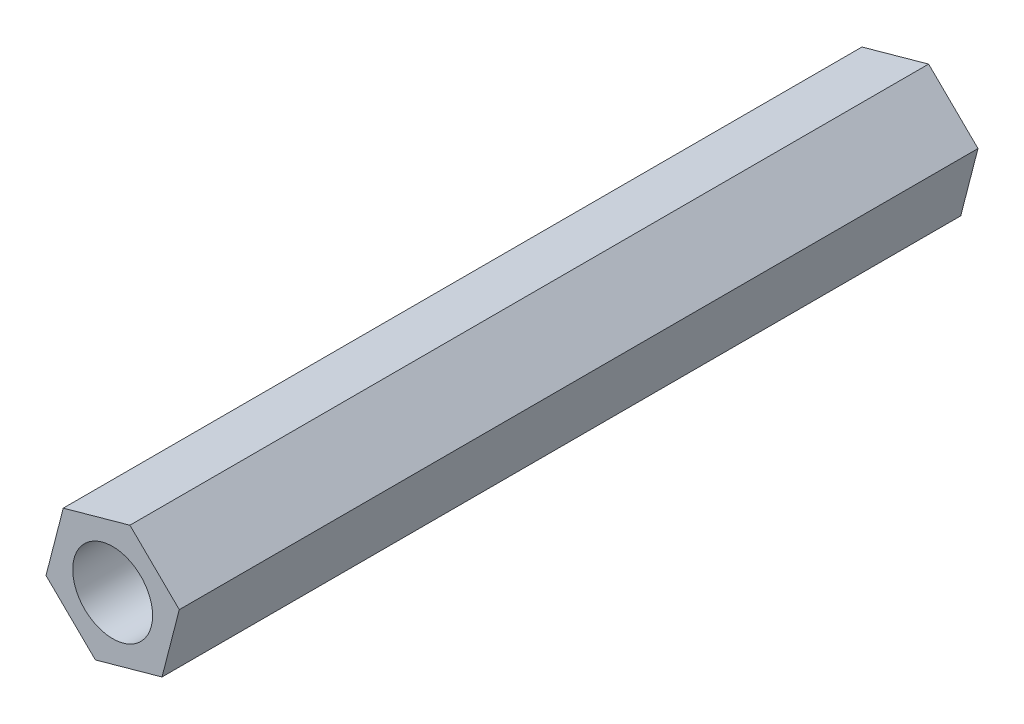
ISO-10303-21;
HEADER;
FILE_DESCRIPTION(('STEP AP214'),'2;1');
FILE_NAME('part.step','',(''),(''),'','','');
FILE_SCHEMA(('AUTOMOTIVE_DESIGN { 1 0 10303 214 1 1 1 1 }'));
ENDSEC;
DATA;
#1=APPLICATION_CONTEXT('core data for automotive mechanical design processes');
#2=APPLICATION_PROTOCOL_DEFINITION('international standard','automotive_design',2000,#1);
#3=PRODUCT_CONTEXT('',#1,'mechanical');
#4=PRODUCT('Part','Part','',(#3));
#5=PRODUCT_RELATED_PRODUCT_CATEGORY('part','',(#4));
#6=PRODUCT_DEFINITION_FORMATION('','',#4);
#7=PRODUCT_DEFINITION_CONTEXT('part definition',#1,'design');
#8=PRODUCT_DEFINITION('design','',#6,#7);
#9=PRODUCT_DEFINITION_SHAPE('','',#8);
#10=(LENGTH_UNIT() NAMED_UNIT(*) SI_UNIT(.MILLI.,.METRE.));
#11=(NAMED_UNIT(*) PLANE_ANGLE_UNIT() SI_UNIT($,.RADIAN.));
#12=(NAMED_UNIT(*) SI_UNIT($,.STERADIAN.) SOLID_ANGLE_UNIT());
#13=UNCERTAINTY_MEASURE_WITH_UNIT(LENGTH_MEASURE(1.E-05),#10,'distance_accuracy_value','');
#14=(GEOMETRIC_REPRESENTATION_CONTEXT(3) GLOBAL_UNCERTAINTY_ASSIGNED_CONTEXT((#13)) GLOBAL_UNIT_ASSIGNED_CONTEXT((#10,
#11,#12)) REPRESENTATION_CONTEXT('',''));
#15=CARTESIAN_POINT('',(0.,0.,0.));
#16=DIRECTION('',(0.,0.,1.));
#17=DIRECTION('',(1.,0.,0.));
#18=AXIS2_PLACEMENT_3D('',#15,#16,#17);
#19=CARTESIAN_POINT('',(-0.4326330238133,-1.67714896974194,-20.));
#20=DIRECTION('',(-0.267834692669189,0.963464881250376,0.));
#21=DIRECTION('',(-0.963464881250376,-0.267834692669189,0.));
#22=AXIS2_PLACEMENT_3D('',#19,#20,#21);
#23=PLANE('',#22);
#24=DIRECTION('',(0.963464881250376,0.267834692669189,0.));
#25=VECTOR('',#24,1.);
#26=CARTESIAN_POINT('',(-0.4326330238133,-1.67714896974194,0.));
#27=LINE('',#26,#25);
#28=CARTESIAN_POINT('',(-0.4326330238133,-1.67714896974194,0.));
#29=VERTEX_POINT('',#28);
#30=CARTESIAN_POINT('',(1.23613710182074,-1.21324567400938,0.));
#31=VERTEX_POINT('',#30);
#32=EDGE_CURVE('E116',#29,#31,#27,.T.);
#33=ORIENTED_EDGE('',*,*,#32,.F.);
#34=DIRECTION('',(0.,0.,0.999999999999999));
#35=VECTOR('',#34,1.);
#36=CARTESIAN_POINT('',(-0.4326330238133,-1.67714896974194,-20.));
#37=LINE('',#36,#35);
#38=CARTESIAN_POINT('',(-0.4326330238133,-1.67714896974194,-20.));
#39=VERTEX_POINT('',#38);
#40=EDGE_CURVE('E115',#39,#29,#37,.T.);
#41=ORIENTED_EDGE('',*,*,#40,.F.);
#42=DIRECTION('',(0.963464881250376,0.267834692669189,0.));
#43=VECTOR('',#42,1.);
#44=CARTESIAN_POINT('',(-0.4326330238133,-1.67714896974194,-20.));
#45=LINE('',#44,#43);
#46=CARTESIAN_POINT('',(1.23613710182074,-1.21324567400938,-20.));
#47=VERTEX_POINT('',#46);
#48=EDGE_CURVE('E129',#39,#47,#45,.T.);
#49=ORIENTED_EDGE('',*,*,#48,.T.);
#50=DIRECTION('',(0.,0.,0.999999999999999));
#51=VECTOR('',#50,1.);
#52=CARTESIAN_POINT('',(1.23613710182074,-1.21324567400938,-20.));
#53=LINE('',#52,#51);
#54=EDGE_CURVE('E11',#47,#31,#53,.T.);
#55=ORIENTED_EDGE('',*,*,#54,.T.);
#56=EDGE_LOOP('',(#33,#41,#49,#55));
#57=FACE_BOUND('',#56,.T.);
#58=ADVANCED_FACE('F33',(#57),#23,.F.);
#59=CARTESIAN_POINT('',(1.23613710182074,-1.21324567400938,-20.));
#60=DIRECTION('',(-0.968302409151578,0.249780792758872,0.));
#61=DIRECTION('',(-0.249780792758872,-0.968302409151578,0.));
#62=AXIS2_PLACEMENT_3D('',#59,#60,#61);
#63=PLANE('',#62);
#64=DIRECTION('',(0.249780792758872,0.968302409151578,0.));
#65=VECTOR('',#64,1.);
#66=CARTESIAN_POINT('',(1.23613710182074,-1.21324567400938,0.));
#67=LINE('',#66,#65);
#68=CARTESIAN_POINT('',(1.66877012563399,0.463903295732621,0.));
#69=VERTEX_POINT('',#68);
#70=EDGE_CURVE('E118',#31,#69,#67,.T.);
#71=ORIENTED_EDGE('',*,*,#70,.F.);
#72=ORIENTED_EDGE('',*,*,#54,.F.);
#73=DIRECTION('',(0.249780792758872,0.968302409151578,0.));
#74=VECTOR('',#73,1.);
#75=CARTESIAN_POINT('',(1.23613710182074,-1.21324567400938,-20.));
#76=LINE('',#75,#74);
#77=CARTESIAN_POINT('',(1.66877012563399,0.463903295732621,-20.));
#78=VERTEX_POINT('',#77);
#79=EDGE_CURVE('E81',#47,#78,#76,.T.);
#80=ORIENTED_EDGE('',*,*,#79,.T.);
#81=DIRECTION('',(0.,0.,0.999999999999999));
#82=VECTOR('',#81,1.);
#83=CARTESIAN_POINT('',(1.66877012563399,0.463903295732621,-20.));
#84=LINE('',#83,#82);
#85=EDGE_CURVE('E41',#78,#69,#84,.T.);
#86=ORIENTED_EDGE('',*,*,#85,.T.);
#87=EDGE_LOOP('',(#71,#72,#80,#86));
#88=FACE_BOUND('',#87,.T.);
#89=ADVANCED_FACE('F135',(#88),#63,.F.);
#90=CARTESIAN_POINT('',(1.66877012563399,0.463903295732621,-20.));
#91=DIRECTION('',(-0.700467716482389,-0.713684088491503,0.));
#92=DIRECTION('',(0.713684088491503,-0.700467716482389,0.));
#93=AXIS2_PLACEMENT_3D('',#90,#91,#92);
#94=PLANE('',#93);
#95=DIRECTION('',(-0.713684088491503,0.700467716482388,0.));
#96=VECTOR('',#95,1.);
#97=CARTESIAN_POINT('',(1.66877012563399,0.463903295732621,0.));
#98=LINE('',#97,#96);
#99=CARTESIAN_POINT('',(0.432633023813161,1.67714896974183,0.));
#100=VERTEX_POINT('',#99);
#101=EDGE_CURVE('E122',#69,#100,#98,.T.);
#102=ORIENTED_EDGE('',*,*,#101,.F.);
#103=ORIENTED_EDGE('',*,*,#85,.F.);
#104=DIRECTION('',(-0.713684088491503,0.700467716482388,0.));
#105=VECTOR('',#104,1.);
#106=CARTESIAN_POINT('',(1.66877012563399,0.463903295732621,-20.));
#107=LINE('',#106,#105);
#108=CARTESIAN_POINT('',(0.432633023813161,1.67714896974183,-20.));
#109=VERTEX_POINT('',#108);
#110=EDGE_CURVE('E109',#78,#109,#107,.T.);
#111=ORIENTED_EDGE('',*,*,#110,.T.);
#112=DIRECTION('',(0.,0.,0.999999999999999));
#113=VECTOR('',#112,1.);
#114=CARTESIAN_POINT('',(0.432633023813161,1.67714896974183,-20.));
#115=LINE('',#114,#113);
#116=EDGE_CURVE('E103',#109,#100,#115,.T.);
#117=ORIENTED_EDGE('',*,*,#116,.T.);
#118=EDGE_LOOP('',(#102,#103,#111,#117));
#119=FACE_BOUND('',#118,.T.);
#120=ADVANCED_FACE('F168',(#119),#94,.F.);
#121=CARTESIAN_POINT('',(0.432633023813161,1.67714896974183,-20.));
#122=DIRECTION('',(0.267834692669189,-0.963464881250376,0.));
#123=DIRECTION('',(0.963464881250376,0.267834692669189,0.));
#124=AXIS2_PLACEMENT_3D('',#121,#122,#123);
#125=PLANE('',#124);
#126=DIRECTION('',(-0.963464881250376,-0.267834692669189,0.));
#127=VECTOR('',#126,1.);
#128=CARTESIAN_POINT('',(0.432633023813161,1.67714896974183,0.));
#129=LINE('',#128,#127);
#130=CARTESIAN_POINT('',(-1.2361371018208,1.21324567400924,0.));
#131=VERTEX_POINT('',#130);
#132=EDGE_CURVE('E125',#100,#131,#129,.T.);
#133=ORIENTED_EDGE('',*,*,#132,.F.);
#134=ORIENTED_EDGE('',*,*,#116,.F.);
#135=DIRECTION('',(-0.963464881250376,-0.267834692669189,0.));
#136=VECTOR('',#135,1.);
#137=CARTESIAN_POINT('',(0.432633023813161,1.67714896974183,-20.));
#138=LINE('',#137,#136);
#139=CARTESIAN_POINT('',(-1.2361371018208,1.21324567400924,-20.));
#140=VERTEX_POINT('',#139);
#141=EDGE_CURVE('E93',#109,#140,#138,.T.);
#142=ORIENTED_EDGE('',*,*,#141,.T.);
#143=DIRECTION('',(0.,0.,0.999999999999999));
#144=VECTOR('',#143,1.);
#145=CARTESIAN_POINT('',(-1.2361371018208,1.21324567400924,-20.));
#146=LINE('',#145,#144);
#147=EDGE_CURVE('E98',#140,#131,#146,.T.);
#148=ORIENTED_EDGE('',*,*,#147,.T.);
#149=EDGE_LOOP('',(#133,#134,#142,#148));
#150=FACE_BOUND('',#149,.T.);
#151=ADVANCED_FACE('F106',(#150),#125,.F.);
#152=CARTESIAN_POINT('',(-1.2361371018208,1.21324567400924,-20.));
#153=DIRECTION('',(0.968302409151578,-0.249780792758873,0.));
#154=DIRECTION('',(0.249780792758873,0.968302409151578,0.));
#155=AXIS2_PLACEMENT_3D('',#152,#153,#154);
#156=PLANE('',#155);
#157=DIRECTION('',(-0.249780792758872,-0.968302409151577,0.));
#158=VECTOR('',#157,1.);
#159=CARTESIAN_POINT('',(-1.2361371018208,1.21324567400924,0.));
#160=LINE('',#159,#158);
#161=CARTESIAN_POINT('',(-1.66877012563399,-0.463903295732676,0.));
#162=VERTEX_POINT('',#161);
#163=EDGE_CURVE('E100',#131,#162,#160,.T.);
#164=ORIENTED_EDGE('',*,*,#163,.F.);
#165=ORIENTED_EDGE('',*,*,#147,.F.);
#166=DIRECTION('',(-0.249780792758872,-0.968302409151577,0.));
#167=VECTOR('',#166,1.);
#168=CARTESIAN_POINT('',(-1.2361371018208,1.21324567400924,-20.));
#169=LINE('',#168,#167);
#170=CARTESIAN_POINT('',(-1.66877012563399,-0.463903295732676,-20.));
#171=VERTEX_POINT('',#170);
#172=EDGE_CURVE('E89',#140,#171,#169,.T.);
#173=ORIENTED_EDGE('',*,*,#172,.T.);
#174=DIRECTION('',(0.,0.,0.999999999999999));
#175=VECTOR('',#174,1.);
#176=CARTESIAN_POINT('',(-1.66877012563399,-0.463903295732676,-20.));
#177=LINE('',#176,#175);
#178=EDGE_CURVE('E104',#171,#162,#177,.T.);
#179=ORIENTED_EDGE('',*,*,#178,.T.);
#180=EDGE_LOOP('',(#164,#165,#173,#179));
#181=FACE_BOUND('',#180,.T.);
#182=ADVANCED_FACE('F99',(#181),#156,.F.);
#183=CARTESIAN_POINT('',(-1.66877012563399,-0.463903295732676,-20.));
#184=DIRECTION('',(0.700467716482389,0.713684088491503,0.));
#185=DIRECTION('',(-0.713684088491503,0.700467716482389,0.));
#186=AXIS2_PLACEMENT_3D('',#183,#184,#185);
#187=PLANE('',#186);
#188=DIRECTION('',(0.713684088491503,-0.700467716482389,0.));
#189=VECTOR('',#188,1.);
#190=CARTESIAN_POINT('',(-1.66877012563399,-0.463903295732676,0.));
#191=LINE('',#190,#189);
#192=EDGE_CURVE('E69',#162,#29,#191,.T.);
#193=ORIENTED_EDGE('',*,*,#192,.F.);
#194=ORIENTED_EDGE('',*,*,#178,.F.);
#195=DIRECTION('',(0.713684088491503,-0.700467716482389,0.));
#196=VECTOR('',#195,1.);
#197=CARTESIAN_POINT('',(-1.66877012563399,-0.463903295732676,-20.));
#198=LINE('',#197,#196);
#199=EDGE_CURVE('E49',#171,#39,#198,.T.);
#200=ORIENTED_EDGE('',*,*,#199,.T.);
#201=ORIENTED_EDGE('',*,*,#40,.T.);
#202=EDGE_LOOP('',(#193,#194,#200,#201));
#203=FACE_BOUND('',#202,.T.);
#204=ADVANCED_FACE('F160',(#203),#187,.F.);
#205=CARTESIAN_POINT('',(0.,0.,-20.));
#206=DIRECTION('',(0.,0.,-0.999999999999999));
#207=DIRECTION('',(1.,0.,0.));
#208=AXIS2_PLACEMENT_3D('',#205,#206,#207);
#209=PLANE('',#208);
#210=CARTESIAN_POINT('',(0.,0.,-20.));
#211=DIRECTION('',(0.,0.,0.999999999999999));
#212=DIRECTION('',(1.,0.,0.));
#213=AXIS2_PLACEMENT_3D('',#210,#211,#212);
#214=CIRCLE('',#213,1.);
#215=CARTESIAN_POINT('',(1.,0.,-20.));
#216=VERTEX_POINT('',#215);
#217=EDGE_CURVE('E144',#216,#216,#214,.T.);
#218=ORIENTED_EDGE('',*,*,#217,.T.);
#219=EDGE_LOOP('',(#218));
#220=FACE_BOUND('',#219,.T.);
#221=ORIENTED_EDGE('',*,*,#48,.F.);
#222=ORIENTED_EDGE('',*,*,#199,.F.);
#223=ORIENTED_EDGE('',*,*,#172,.F.);
#224=ORIENTED_EDGE('',*,*,#141,.F.);
#225=ORIENTED_EDGE('',*,*,#110,.F.);
#226=ORIENTED_EDGE('',*,*,#79,.F.);
#227=EDGE_LOOP('',(#221,#222,#223,#224,#225,#226));
#228=FACE_BOUND('',#227,.T.);
#229=ADVANCED_FACE('F91',(#220,#228),#209,.T.);
#230=CARTESIAN_POINT('',(0.,0.,0.));
#231=DIRECTION('',(0.,0.,-0.999999999999999));
#232=DIRECTION('',(1.,0.,0.));
#233=AXIS2_PLACEMENT_3D('',#230,#231,#232);
#234=PLANE('',#233);
#235=CARTESIAN_POINT('',(0.,0.,0.));
#236=DIRECTION('',(0.,0.,0.999999999999999));
#237=DIRECTION('',(1.,0.,0.));
#238=AXIS2_PLACEMENT_3D('',#235,#236,#237);
#239=CIRCLE('',#238,1.);
#240=CARTESIAN_POINT('',(1.,0.,0.));
#241=VERTEX_POINT('',#240);
#242=EDGE_CURVE('E119',#241,#241,#239,.T.);
#243=ORIENTED_EDGE('',*,*,#242,.F.);
#244=EDGE_LOOP('',(#243));
#245=FACE_BOUND('',#244,.T.);
#246=ORIENTED_EDGE('',*,*,#32,.T.);
#247=ORIENTED_EDGE('',*,*,#70,.T.);
#248=ORIENTED_EDGE('',*,*,#101,.T.);
#249=ORIENTED_EDGE('',*,*,#132,.T.);
#250=ORIENTED_EDGE('',*,*,#163,.T.);
#251=ORIENTED_EDGE('',*,*,#192,.T.);
#252=EDGE_LOOP('',(#246,#247,#248,#249,#250,#251));
#253=FACE_BOUND('',#252,.T.);
#254=ADVANCED_FACE('F137',(#245,#253),#234,.F.);
#255=CARTESIAN_POINT('',(0.,0.,0.));
#256=DIRECTION('',(0.,0.,-0.999999999999999));
#257=DIRECTION('',(1.,0.,0.));
#258=AXIS2_PLACEMENT_3D('',#255,#256,#257);
#259=CYLINDRICAL_SURFACE('',#258,1.);
#260=CARTESIAN_POINT('',(1.,0.,0.));
#261=CARTESIAN_POINT('',(1.,0.,-0.208333333333334));
#262=CARTESIAN_POINT('',(1.,0.,-0.416666666666667));
#263=CARTESIAN_POINT('',(1.,0.,-0.833333333333334));
#264=CARTESIAN_POINT('',(1.,0.,-1.04166666666667));
#265=CARTESIAN_POINT('',(1.,0.,-1.45833333333333));
#266=CARTESIAN_POINT('',(1.,0.,-1.66666666666667));
#267=CARTESIAN_POINT('',(1.,0.,-2.08333333333334));
#268=CARTESIAN_POINT('',(1.,0.,-2.29166666666667));
#269=CARTESIAN_POINT('',(1.,0.,-2.70833333333334));
#270=CARTESIAN_POINT('',(1.,0.,-2.91666666666667));
#271=CARTESIAN_POINT('',(1.,0.,-3.33333333333334));
#272=CARTESIAN_POINT('',(1.,0.,-3.54166666666667));
#273=CARTESIAN_POINT('',(1.,0.,-3.95833333333334));
#274=CARTESIAN_POINT('',(1.,0.,-4.16666666666667));
#275=CARTESIAN_POINT('',(1.,0.,-4.58333333333334));
#276=CARTESIAN_POINT('',(1.,0.,-4.79166666666667));
#277=CARTESIAN_POINT('',(1.,0.,-5.20833333333334));
#278=CARTESIAN_POINT('',(1.,0.,-5.41666666666667));
#279=CARTESIAN_POINT('',(1.,0.,-5.83333333333334));
#280=CARTESIAN_POINT('',(1.,0.,-6.04166666666667));
#281=CARTESIAN_POINT('',(1.,0.,-6.45833333333334));
#282=CARTESIAN_POINT('',(1.,0.,-6.66666666666667));
#283=CARTESIAN_POINT('',(1.,0.,-7.08333333333334));
#284=CARTESIAN_POINT('',(1.,0.,-7.29166666666667));
#285=CARTESIAN_POINT('',(1.,0.,-7.70833333333334));
#286=CARTESIAN_POINT('',(1.,0.,-7.91666666666667));
#287=CARTESIAN_POINT('',(1.,0.,-8.33333333333334));
#288=CARTESIAN_POINT('',(1.,0.,-8.54166666666667));
#289=CARTESIAN_POINT('',(1.,0.,-8.95833333333334));
#290=CARTESIAN_POINT('',(1.,0.,-9.16666666666667));
#291=CARTESIAN_POINT('',(1.,0.,-9.58333333333334));
#292=CARTESIAN_POINT('',(1.,0.,-9.79166666666668));
#293=CARTESIAN_POINT('',(1.,0.,-10.2083333333333));
#294=CARTESIAN_POINT('',(1.,0.,-10.4166666666667));
#295=CARTESIAN_POINT('',(1.,0.,-10.8333333333333));
#296=CARTESIAN_POINT('',(1.,0.,-11.0416666666667));
#297=CARTESIAN_POINT('',(1.,0.,-11.4583333333333));
#298=CARTESIAN_POINT('',(1.,0.,-11.6666666666667));
#299=CARTESIAN_POINT('',(1.,0.,-12.0833333333333));
#300=CARTESIAN_POINT('',(1.,0.,-12.2916666666667));
#301=CARTESIAN_POINT('',(1.,0.,-12.7083333333333));
#302=CARTESIAN_POINT('',(1.,0.,-12.9166666666667));
#303=CARTESIAN_POINT('',(1.,0.,-13.3333333333333));
#304=CARTESIAN_POINT('',(1.,0.,-13.5416666666667));
#305=CARTESIAN_POINT('',(1.,0.,-13.9583333333333));
#306=CARTESIAN_POINT('',(1.,0.,-14.1666666666667));
#307=CARTESIAN_POINT('',(1.,0.,-14.5833333333333));
#308=CARTESIAN_POINT('',(1.,0.,-14.7916666666667));
#309=CARTESIAN_POINT('',(1.,0.,-15.2083333333333));
#310=CARTESIAN_POINT('',(1.,0.,-15.4166666666667));
#311=CARTESIAN_POINT('',(1.,0.,-15.8333333333333));
#312=CARTESIAN_POINT('',(1.,0.,-16.0416666666667));
#313=CARTESIAN_POINT('',(1.,0.,-16.4583333333333));
#314=CARTESIAN_POINT('',(1.,0.,-16.6666666666667));
#315=CARTESIAN_POINT('',(1.,0.,-17.0833333333333));
#316=CARTESIAN_POINT('',(1.,0.,-17.2916666666667));
#317=CARTESIAN_POINT('',(1.,0.,-17.7083333333333));
#318=CARTESIAN_POINT('',(1.,0.,-17.9166666666667));
#319=CARTESIAN_POINT('',(1.,0.,-18.3333333333333));
#320=CARTESIAN_POINT('',(1.,0.,-18.5416666666667));
#321=CARTESIAN_POINT('',(1.,0.,-18.9583333333334));
#322=CARTESIAN_POINT('',(1.,0.,-19.1666666666667));
#323=CARTESIAN_POINT('',(1.,0.,-19.5833333333334));
#324=CARTESIAN_POINT('',(1.,0.,-19.7916666666667));
#325=CARTESIAN_POINT('',(1.,0.,-20.));
#326=B_SPLINE_CURVE_WITH_KNOTS('',3,(#260,#261,#262,#263,#264,#265,#266,#267,#268,#269,#270,
#271,#272,#273,#274,#275,#276,#277,#278,#279,#280,#281,#282,#283,#284,#285,#286,#287,#288,#289,
#290,#291,#292,#293,#294,#295,#296,#297,#298,#299,#300,#301,#302,#303,#304,#305,#306,#307,#308,
#309,#310,#311,#312,#313,#314,#315,#316,#317,#318,#319,#320,#321,#322,#323,#324,#325),
.UNSPECIFIED.,.F.,.F.,(4,2,2,2,2,2,2,2,2,2,2,2,2,2,2,2,2,2,2,2,2,2,2,2,2,2,2,2,2,2,2,2,4),(0.,
0.625000000000001,1.25,1.875,2.5,3.125,3.75,4.375,5.,5.62500000000001,6.25000000000001,
6.87500000000001,7.50000000000001,8.12500000000001,8.75000000000001,9.37500000000001,10.,10.625,
11.25,11.875,12.5,13.125,13.75,14.375,15.,15.625,16.25,16.875,17.5,18.125,18.75,19.375,20.),.UNSPECIFIED.);
#327=EDGE_CURVE('BSEAM150',#241,#216,#326,.T.);
#328=ORIENTED_EDGE('',*,*,#242,.T.);
#329=ORIENTED_EDGE('',*,*,#217,.F.);
#330=ORIENTED_EDGE('',*,*,#327,.T.);
#331=ORIENTED_EDGE('',*,*,#327,.F.);
#332=EDGE_LOOP('',(#328,#330,#329,#331));
#333=FACE_BOUND('',#332,.T.);
#334=ADVANCED_FACE('F150',(#333),#259,.F.);
#335=CLOSED_SHELL('',(#58,#89,#120,#151,#182,#204,#229,#254,#334));
#336=MANIFOLD_SOLID_BREP('B2',#335);
#337=ADVANCED_BREP_SHAPE_REPRESENTATION('',(#18,#336),#14);
#338=SHAPE_DEFINITION_REPRESENTATION(#9,#337);
ENDSEC;
END-ISO-10303-21;
